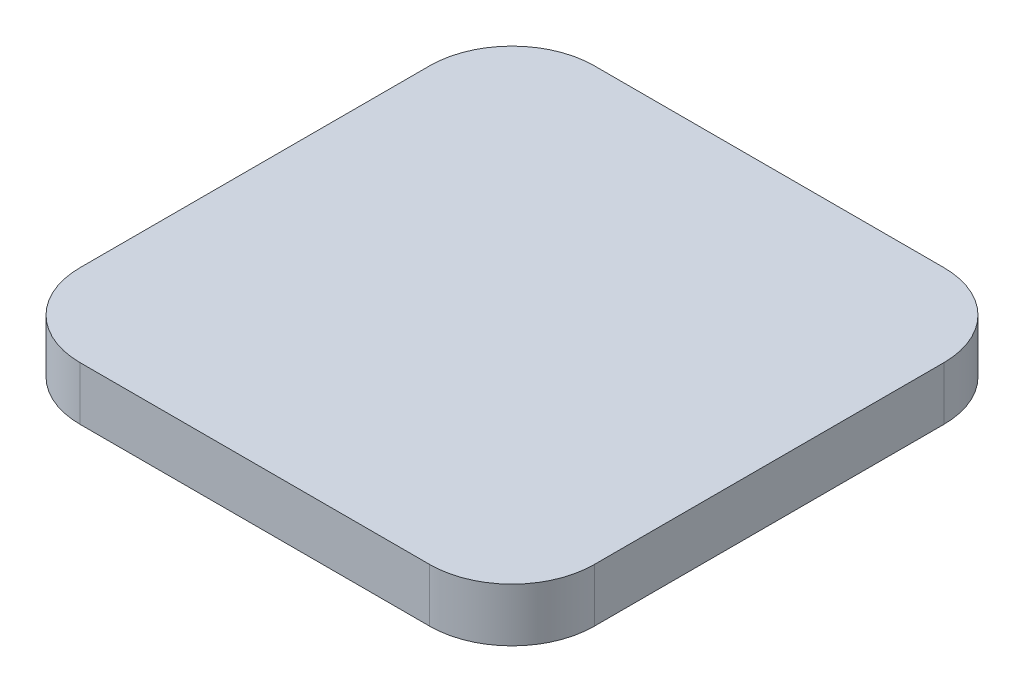
ISO-10303-21;
HEADER;
FILE_DESCRIPTION(('STEP AP214'),'2;1');
FILE_NAME('part.step','',(''),(''),'','','');
FILE_SCHEMA(('AUTOMOTIVE_DESIGN { 1 0 10303 214 1 1 1 1 }'));
ENDSEC;
DATA;
#1=APPLICATION_CONTEXT('core data for automotive mechanical design processes');
#2=APPLICATION_PROTOCOL_DEFINITION('international standard','automotive_design',2000,#1);
#3=PRODUCT_CONTEXT('',#1,'mechanical');
#4=PRODUCT('Part','Part','',(#3));
#5=PRODUCT_RELATED_PRODUCT_CATEGORY('part','',(#4));
#6=PRODUCT_DEFINITION_FORMATION('','',#4);
#7=PRODUCT_DEFINITION_CONTEXT('part definition',#1,'design');
#8=PRODUCT_DEFINITION('design','',#6,#7);
#9=PRODUCT_DEFINITION_SHAPE('','',#8);
#10=(LENGTH_UNIT() NAMED_UNIT(*) SI_UNIT(.MILLI.,.METRE.));
#11=(NAMED_UNIT(*) PLANE_ANGLE_UNIT() SI_UNIT($,.RADIAN.));
#12=(NAMED_UNIT(*) SI_UNIT($,.STERADIAN.) SOLID_ANGLE_UNIT());
#13=UNCERTAINTY_MEASURE_WITH_UNIT(LENGTH_MEASURE(1.E-05),#10,'distance_accuracy_value','');
#14=(GEOMETRIC_REPRESENTATION_CONTEXT(3) GLOBAL_UNCERTAINTY_ASSIGNED_CONTEXT((#13)) GLOBAL_UNIT_ASSIGNED_CONTEXT((#10,
#11,#12)) REPRESENTATION_CONTEXT('',''));
#15=CARTESIAN_POINT('',(0.,0.,0.));
#16=DIRECTION('',(0.,0.,1.));
#17=DIRECTION('',(1.,0.,0.));
#18=AXIS2_PLACEMENT_3D('',#15,#16,#17);
#19=CARTESIAN_POINT('',(0.,0.,0.));
#20=DIRECTION('',(0.,-1.,0.));
#21=DIRECTION('',(0.,0.,-1.));
#22=AXIS2_PLACEMENT_3D('',#19,#20,#21);
#23=PLANE('',#22);
#24=DIRECTION('',(-1.,0.,0.));
#25=VECTOR('',#24,1.);
#26=CARTESIAN_POINT('',(-12.5,0.,-12.5));
#27=LINE('',#26,#25);
#28=CARTESIAN_POINT('',(8.49999999999999,0.,-12.5));
#29=VERTEX_POINT('',#28);
#30=CARTESIAN_POINT('',(-8.50000000000001,0.,-12.5));
#31=VERTEX_POINT('',#30);
#32=EDGE_CURVE('E117',#29,#31,#27,.T.);
#33=ORIENTED_EDGE('',*,*,#32,.F.);
#34=CARTESIAN_POINT('',(8.49999999999999,0.,-8.50000000000001));
#35=DIRECTION('',(0.,-1.,0.));
#36=DIRECTION('',(0.,0.,-1.));
#37=AXIS2_PLACEMENT_3D('',#34,#35,#36);
#38=CIRCLE('',#37,4.);
#39=CARTESIAN_POINT('',(12.5,0.,-8.50000000000001));
#40=VERTEX_POINT('',#39);
#41=EDGE_CURVE('E100',#29,#40,#38,.T.);
#42=ORIENTED_EDGE('',*,*,#41,.T.);
#43=DIRECTION('',(0.,0.,-1.));
#44=VECTOR('',#43,1.);
#45=CARTESIAN_POINT('',(12.5,0.,12.5));
#46=LINE('',#45,#44);
#47=CARTESIAN_POINT('',(12.5,0.,8.49999999999999));
#48=VERTEX_POINT('',#47);
#49=EDGE_CURVE('E128',#48,#40,#46,.T.);
#50=ORIENTED_EDGE('',*,*,#49,.F.);
#51=CARTESIAN_POINT('',(8.49999999999999,0.,8.49999999999999));
#52=DIRECTION('',(0.,-1.,0.));
#53=DIRECTION('',(0.,0.,-1.));
#54=AXIS2_PLACEMENT_3D('',#51,#52,#53);
#55=CIRCLE('',#54,4.);
#56=CARTESIAN_POINT('',(8.49999999999999,0.,12.5));
#57=VERTEX_POINT('',#56);
#58=EDGE_CURVE('E111',#48,#57,#55,.T.);
#59=ORIENTED_EDGE('',*,*,#58,.T.);
#60=DIRECTION('',(1.,0.,0.));
#61=VECTOR('',#60,1.);
#62=CARTESIAN_POINT('',(-12.5,0.,12.5));
#63=LINE('',#62,#61);
#64=CARTESIAN_POINT('',(-8.50000000000001,0.,12.5));
#65=VERTEX_POINT('',#64);
#66=EDGE_CURVE('E131',#65,#57,#63,.T.);
#67=ORIENTED_EDGE('',*,*,#66,.F.);
#68=CARTESIAN_POINT('',(-8.50000000000001,0.,8.49999999999999));
#69=DIRECTION('',(0.,-1.,0.));
#70=DIRECTION('',(0.,0.,-1.));
#71=AXIS2_PLACEMENT_3D('',#68,#69,#70);
#72=CIRCLE('',#71,4.);
#73=CARTESIAN_POINT('',(-12.5,0.,8.49999999999999));
#74=VERTEX_POINT('',#73);
#75=EDGE_CURVE('E121',#65,#74,#72,.T.);
#76=ORIENTED_EDGE('',*,*,#75,.T.);
#77=DIRECTION('',(0.,0.,1.));
#78=VECTOR('',#77,1.);
#79=CARTESIAN_POINT('',(-12.5,0.,12.5));
#80=LINE('',#79,#78);
#81=CARTESIAN_POINT('',(-12.5,0.,-8.50000000000001));
#82=VERTEX_POINT('',#81);
#83=EDGE_CURVE('E127',#82,#74,#80,.T.);
#84=ORIENTED_EDGE('',*,*,#83,.F.);
#85=CARTESIAN_POINT('',(-8.50000000000001,0.,-8.50000000000001));
#86=DIRECTION('',(0.,-1.,0.));
#87=DIRECTION('',(0.,0.,-1.));
#88=AXIS2_PLACEMENT_3D('',#85,#86,#87);
#89=CIRCLE('',#88,4.);
#90=EDGE_CURVE('E126',#82,#31,#89,.T.);
#91=ORIENTED_EDGE('',*,*,#90,.T.);
#92=EDGE_LOOP('',(#33,#42,#50,#59,#67,#76,#84,#91));
#93=FACE_BOUND('',#92,.T.);
#94=CARTESIAN_POINT('',(0.,0.,-2.5));
#95=DIRECTION('',(0.,-1.,0.));
#96=DIRECTION('',(0.,0.,-1.));
#97=AXIS2_PLACEMENT_3D('',#94,#95,#96);
#98=CIRCLE('',#97,0.4);
#99=CARTESIAN_POINT('',(0.,0.,-2.9));
#100=VERTEX_POINT('',#99);
#101=EDGE_CURVE('E181',#100,#100,#98,.T.);
#102=ORIENTED_EDGE('',*,*,#101,.F.);
#103=EDGE_LOOP('',(#102));
#104=FACE_BOUND('',#103,.T.);
#105=ADVANCED_FACE('F33',(#93,#104),#23,.T.);
#106=CARTESIAN_POINT('',(12.5,2.6,12.5));
#107=DIRECTION('',(-1.,0.,0.));
#108=DIRECTION('',(0.,0.,1.));
#109=AXIS2_PLACEMENT_3D('',#106,#107,#108);
#110=PLANE('',#109);
#111=ORIENTED_EDGE('',*,*,#49,.T.);
#112=DIRECTION('',(0.,-1.,0.));
#113=VECTOR('',#112,1.);
#114=CARTESIAN_POINT('',(12.5,2.6,-8.50000000000001));
#115=LINE('',#114,#113);
#116=CARTESIAN_POINT('',(12.5,2.6,-8.50000000000001));
#117=VERTEX_POINT('',#116);
#118=EDGE_CURVE('E105',#40,#117,#115,.F.);
#119=ORIENTED_EDGE('',*,*,#118,.T.);
#120=DIRECTION('',(0.,0.,-1.));
#121=VECTOR('',#120,1.);
#122=CARTESIAN_POINT('',(12.5,2.6,12.5));
#123=LINE('',#122,#121);
#124=CARTESIAN_POINT('',(12.5,2.6,8.49999999999999));
#125=VERTEX_POINT('',#124);
#126=EDGE_CURVE('E138',#125,#117,#123,.T.);
#127=ORIENTED_EDGE('',*,*,#126,.F.);
#128=DIRECTION('',(0.,-1.,0.));
#129=VECTOR('',#128,1.);
#130=CARTESIAN_POINT('',(12.5,2.6,8.49999999999999));
#131=LINE('',#130,#129);
#132=EDGE_CURVE('E110',#125,#48,#131,.T.);
#133=ORIENTED_EDGE('',*,*,#132,.T.);
#134=EDGE_LOOP('',(#111,#119,#127,#133));
#135=FACE_BOUND('',#134,.T.);
#136=ADVANCED_FACE('F177',(#135),#110,.F.);
#137=CARTESIAN_POINT('',(-12.5,2.6,-12.5));
#138=DIRECTION('',(0.,0.,1.));
#139=DIRECTION('',(1.,0.,0.));
#140=AXIS2_PLACEMENT_3D('',#137,#138,#139);
#141=PLANE('',#140);
#142=DIRECTION('',(-1.,0.,0.));
#143=VECTOR('',#142,1.);
#144=CARTESIAN_POINT('',(-12.5,2.6,-12.5));
#145=LINE('',#144,#143);
#146=CARTESIAN_POINT('',(8.49999999999999,2.6,-12.5));
#147=VERTEX_POINT('',#146);
#148=CARTESIAN_POINT('',(-8.50000000000001,2.6,-12.5));
#149=VERTEX_POINT('',#148);
#150=EDGE_CURVE('E120',#147,#149,#145,.T.);
#151=ORIENTED_EDGE('',*,*,#150,.F.);
#152=DIRECTION('',(0.,-1.,0.));
#153=VECTOR('',#152,1.);
#154=CARTESIAN_POINT('',(8.49999999999999,2.6,-12.5));
#155=LINE('',#154,#153);
#156=EDGE_CURVE('E104',#147,#29,#155,.T.);
#157=ORIENTED_EDGE('',*,*,#156,.T.);
#158=ORIENTED_EDGE('',*,*,#32,.T.);
#159=DIRECTION('',(0.,-1.,0.));
#160=VECTOR('',#159,1.);
#161=CARTESIAN_POINT('',(-8.50000000000001,2.6,-12.5));
#162=LINE('',#161,#160);
#163=EDGE_CURVE('E122',#31,#149,#162,.F.);
#164=ORIENTED_EDGE('',*,*,#163,.T.);
#165=EDGE_LOOP('',(#151,#157,#158,#164));
#166=FACE_BOUND('',#165,.T.);
#167=ADVANCED_FACE('F116',(#166),#141,.F.);
#168=CARTESIAN_POINT('',(-12.5,2.6,12.5));
#169=DIRECTION('',(1.,0.,0.));
#170=DIRECTION('',(0.,0.,-1.));
#171=AXIS2_PLACEMENT_3D('',#168,#169,#170);
#172=PLANE('',#171);
#173=DIRECTION('',(0.,0.,1.));
#174=VECTOR('',#173,1.);
#175=CARTESIAN_POINT('',(-12.5,2.6,12.5));
#176=LINE('',#175,#174);
#177=CARTESIAN_POINT('',(-12.5,2.6,-8.50000000000001));
#178=VERTEX_POINT('',#177);
#179=CARTESIAN_POINT('',(-12.5,2.6,8.49999999999999));
#180=VERTEX_POINT('',#179);
#181=EDGE_CURVE('E161',#178,#180,#176,.T.);
#182=ORIENTED_EDGE('',*,*,#181,.F.);
#183=DIRECTION('',(0.,-1.,0.));
#184=VECTOR('',#183,1.);
#185=CARTESIAN_POINT('',(-12.5,2.6,-8.50000000000001));
#186=LINE('',#185,#184);
#187=EDGE_CURVE('E11',#178,#82,#186,.T.);
#188=ORIENTED_EDGE('',*,*,#187,.T.);
#189=ORIENTED_EDGE('',*,*,#83,.T.);
#190=DIRECTION('',(0.,-1.,0.));
#191=VECTOR('',#190,1.);
#192=CARTESIAN_POINT('',(-12.5,2.6,8.49999999999999));
#193=LINE('',#192,#191);
#194=EDGE_CURVE('E41',#74,#180,#193,.F.);
#195=ORIENTED_EDGE('',*,*,#194,.T.);
#196=EDGE_LOOP('',(#182,#188,#189,#195));
#197=FACE_BOUND('',#196,.T.);
#198=ADVANCED_FACE('F160',(#197),#172,.F.);
#199=CARTESIAN_POINT('',(-12.5,2.6,12.5));
#200=DIRECTION('',(0.,0.,-1.));
#201=DIRECTION('',(-1.,0.,0.));
#202=AXIS2_PLACEMENT_3D('',#199,#200,#201);
#203=PLANE('',#202);
#204=ORIENTED_EDGE('',*,*,#66,.T.);
#205=DIRECTION('',(0.,-1.,0.));
#206=VECTOR('',#205,1.);
#207=CARTESIAN_POINT('',(8.49999999999999,2.6,12.5));
#208=LINE('',#207,#206);
#209=CARTESIAN_POINT('',(8.49999999999999,2.6,12.5));
#210=VERTEX_POINT('',#209);
#211=EDGE_CURVE('E48',#57,#210,#208,.F.);
#212=ORIENTED_EDGE('',*,*,#211,.T.);
#213=DIRECTION('',(1.,0.,0.));
#214=VECTOR('',#213,1.);
#215=CARTESIAN_POINT('',(-12.5,2.6,12.5));
#216=LINE('',#215,#214);
#217=CARTESIAN_POINT('',(-8.50000000000001,2.6,12.5));
#218=VERTEX_POINT('',#217);
#219=EDGE_CURVE('E139',#218,#210,#216,.T.);
#220=ORIENTED_EDGE('',*,*,#219,.F.);
#221=DIRECTION('',(0.,-1.,0.));
#222=VECTOR('',#221,1.);
#223=CARTESIAN_POINT('',(-8.50000000000001,2.6,12.5));
#224=LINE('',#223,#222);
#225=EDGE_CURVE('E154',#218,#65,#224,.T.);
#226=ORIENTED_EDGE('',*,*,#225,.T.);
#227=EDGE_LOOP('',(#204,#212,#220,#226));
#228=FACE_BOUND('',#227,.T.);
#229=ADVANCED_FACE('F170',(#228),#203,.F.);
#230=CARTESIAN_POINT('',(0.,2.6,0.));
#231=DIRECTION('',(0.,-1.,0.));
#232=DIRECTION('',(0.,0.,-1.));
#233=AXIS2_PLACEMENT_3D('',#230,#231,#232);
#234=PLANE('',#233);
#235=ORIENTED_EDGE('',*,*,#126,.T.);
#236=CARTESIAN_POINT('',(8.49999999999999,2.6,-8.50000000000001));
#237=DIRECTION('',(0.,-1.,0.));
#238=DIRECTION('',(0.,0.,-1.));
#239=AXIS2_PLACEMENT_3D('',#236,#237,#238);
#240=CIRCLE('',#239,4.);
#241=EDGE_CURVE('E152',#117,#147,#240,.F.);
#242=ORIENTED_EDGE('',*,*,#241,.T.);
#243=ORIENTED_EDGE('',*,*,#150,.T.);
#244=CARTESIAN_POINT('',(-8.50000000000001,2.6,-8.50000000000001));
#245=DIRECTION('',(0.,-1.,0.));
#246=DIRECTION('',(0.,0.,-1.));
#247=AXIS2_PLACEMENT_3D('',#244,#245,#246);
#248=CIRCLE('',#247,4.);
#249=EDGE_CURVE('E148',#149,#178,#248,.F.);
#250=ORIENTED_EDGE('',*,*,#249,.T.);
#251=ORIENTED_EDGE('',*,*,#181,.T.);
#252=CARTESIAN_POINT('',(-8.50000000000001,2.6,8.49999999999999));
#253=DIRECTION('',(0.,-1.,0.));
#254=DIRECTION('',(0.,0.,-1.));
#255=AXIS2_PLACEMENT_3D('',#252,#253,#254);
#256=CIRCLE('',#255,4.);
#257=EDGE_CURVE('E55',#180,#218,#256,.F.);
#258=ORIENTED_EDGE('',*,*,#257,.T.);
#259=ORIENTED_EDGE('',*,*,#219,.T.);
#260=CARTESIAN_POINT('',(8.49999999999999,2.6,8.49999999999999));
#261=DIRECTION('',(0.,-1.,0.));
#262=DIRECTION('',(0.,0.,-1.));
#263=AXIS2_PLACEMENT_3D('',#260,#261,#262);
#264=CIRCLE('',#263,4.);
#265=EDGE_CURVE('E150',#210,#125,#264,.F.);
#266=ORIENTED_EDGE('',*,*,#265,.T.);
#267=EDGE_LOOP('',(#235,#242,#243,#250,#251,#258,#259,#266));
#268=FACE_BOUND('',#267,.T.);
#269=ADVANCED_FACE('F165',(#268),#234,.F.);
#270=CARTESIAN_POINT('',(8.49999999999999,2.6,-8.50000000000001));
#271=DIRECTION('',(0.,-1.,0.));
#272=DIRECTION('',(0.,0.,-1.));
#273=AXIS2_PLACEMENT_3D('',#270,#271,#272);
#274=CYLINDRICAL_SURFACE('',#273,4.);
#275=ORIENTED_EDGE('',*,*,#241,.F.);
#276=ORIENTED_EDGE('',*,*,#118,.F.);
#277=ORIENTED_EDGE('',*,*,#41,.F.);
#278=ORIENTED_EDGE('',*,*,#156,.F.);
#279=EDGE_LOOP('',(#275,#276,#277,#278));
#280=FACE_BOUND('',#279,.T.);
#281=ADVANCED_FACE('F103',(#280),#274,.T.);
#282=CARTESIAN_POINT('',(8.49999999999999,2.6,8.49999999999999));
#283=DIRECTION('',(0.,-1.,0.));
#284=DIRECTION('',(0.,0.,-1.));
#285=AXIS2_PLACEMENT_3D('',#282,#283,#284);
#286=CYLINDRICAL_SURFACE('',#285,4.);
#287=ORIENTED_EDGE('',*,*,#265,.F.);
#288=ORIENTED_EDGE('',*,*,#211,.F.);
#289=ORIENTED_EDGE('',*,*,#58,.F.);
#290=ORIENTED_EDGE('',*,*,#132,.F.);
#291=EDGE_LOOP('',(#287,#288,#289,#290));
#292=FACE_BOUND('',#291,.T.);
#293=ADVANCED_FACE('F174',(#292),#286,.T.);
#294=CARTESIAN_POINT('',(-8.50000000000001,2.6,-8.50000000000001));
#295=DIRECTION('',(0.,-1.,0.));
#296=DIRECTION('',(0.,0.,-1.));
#297=AXIS2_PLACEMENT_3D('',#294,#295,#296);
#298=CYLINDRICAL_SURFACE('',#297,4.);
#299=ORIENTED_EDGE('',*,*,#249,.F.);
#300=ORIENTED_EDGE('',*,*,#163,.F.);
#301=ORIENTED_EDGE('',*,*,#90,.F.);
#302=ORIENTED_EDGE('',*,*,#187,.F.);
#303=EDGE_LOOP('',(#299,#300,#301,#302));
#304=FACE_BOUND('',#303,.T.);
#305=ADVANCED_FACE('F211',(#304),#298,.T.);
#306=CARTESIAN_POINT('',(-8.50000000000001,2.6,8.49999999999999));
#307=DIRECTION('',(0.,-1.,0.));
#308=DIRECTION('',(0.,0.,-1.));
#309=AXIS2_PLACEMENT_3D('',#306,#307,#308);
#310=CYLINDRICAL_SURFACE('',#309,4.);
#311=ORIENTED_EDGE('',*,*,#257,.F.);
#312=ORIENTED_EDGE('',*,*,#194,.F.);
#313=ORIENTED_EDGE('',*,*,#75,.F.);
#314=ORIENTED_EDGE('',*,*,#225,.F.);
#315=EDGE_LOOP('',(#311,#312,#313,#314));
#316=FACE_BOUND('',#315,.T.);
#317=ADVANCED_FACE('F35',(#316),#310,.T.);
#318=CARTESIAN_POINT('',(0.,-1.9,-2.5));
#319=DIRECTION('',(0.,1.,0.));
#320=DIRECTION('',(0.,0.,1.));
#321=AXIS2_PLACEMENT_3D('',#318,#319,#320);
#322=CYLINDRICAL_SURFACE('',#321,0.4);
#323=CARTESIAN_POINT('',(0.,-1.9,-2.5));
#324=DIRECTION('',(0.,-1.,0.));
#325=DIRECTION('',(0.,0.,-1.));
#326=AXIS2_PLACEMENT_3D('',#323,#324,#325);
#327=CIRCLE('',#326,0.4);
#328=CARTESIAN_POINT('',(0.,-1.9,-2.9));
#329=VERTEX_POINT('',#328);
#330=EDGE_CURVE('E133',#329,#329,#327,.T.);
#331=ORIENTED_EDGE('',*,*,#330,.F.);
#332=EDGE_LOOP('',(#331));
#333=FACE_BOUND('',#332,.T.);
#334=ORIENTED_EDGE('',*,*,#101,.T.);
#335=EDGE_LOOP('',(#334));
#336=FACE_BOUND('',#335,.T.);
#337=ADVANCED_FACE('F189',(#333,#336),#322,.T.);
#338=CARTESIAN_POINT('',(0.,-1.9,-2.5));
#339=DIRECTION('',(0.,-1.,0.));
#340=DIRECTION('',(0.,0.,-1.));
#341=AXIS2_PLACEMENT_3D('',#338,#339,#340);
#342=PLANE('',#341);
#343=ORIENTED_EDGE('',*,*,#330,.T.);
#344=EDGE_LOOP('',(#343));
#345=FACE_BOUND('',#344,.T.);
#346=ADVANCED_FACE('F187',(#345),#342,.T.);
#347=CLOSED_SHELL('',(#105,#136,#167,#198,#229,#269,#281,#293,#305,#317,#337,#346));
#348=MANIFOLD_SOLID_BREP('B2',#347);
#349=ADVANCED_BREP_SHAPE_REPRESENTATION('',(#18,#348),#14);
#350=SHAPE_DEFINITION_REPRESENTATION(#9,#349);
ENDSEC;
END-ISO-10303-21;
